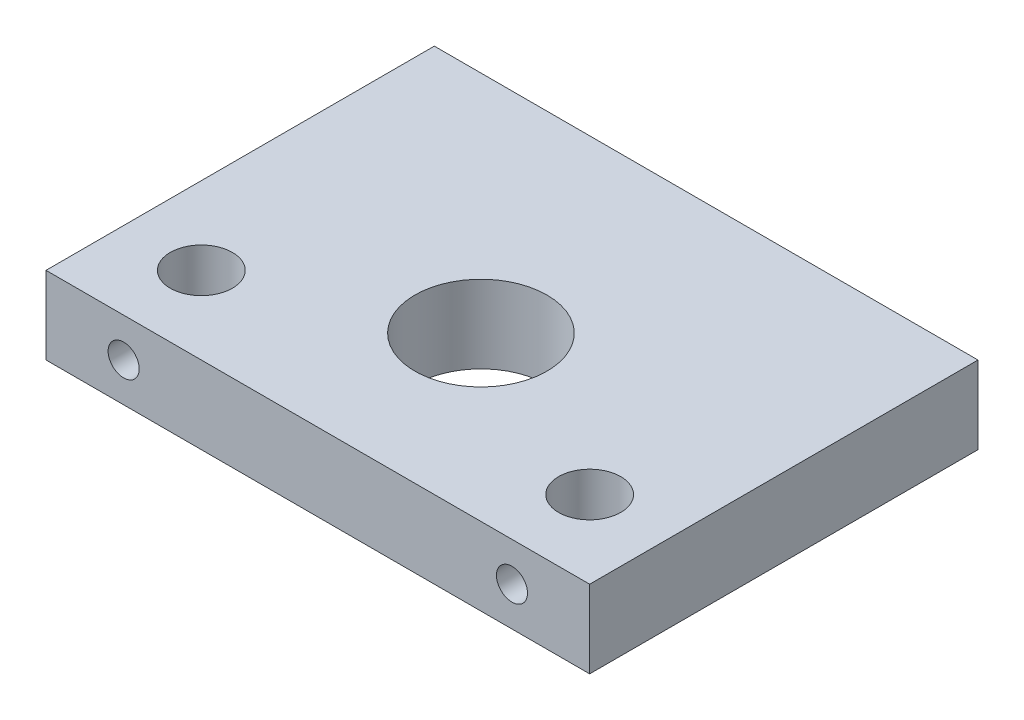
ISO-10303-21;
HEADER;
FILE_DESCRIPTION(('STEP AP214'),'2;1');
FILE_NAME('part.step','',(''),(''),'','','');
FILE_SCHEMA(('AUTOMOTIVE_DESIGN { 1 0 10303 214 1 1 1 1 }'));
ENDSEC;
DATA;
#1=APPLICATION_CONTEXT('core data for automotive mechanical design processes');
#2=APPLICATION_PROTOCOL_DEFINITION('international standard','automotive_design',2000,#1);
#3=PRODUCT_CONTEXT('',#1,'mechanical');
#4=PRODUCT('Part','Part','',(#3));
#5=PRODUCT_RELATED_PRODUCT_CATEGORY('part','',(#4));
#6=PRODUCT_DEFINITION_FORMATION('','',#4);
#7=PRODUCT_DEFINITION_CONTEXT('part definition',#1,'design');
#8=PRODUCT_DEFINITION('design','',#6,#7);
#9=PRODUCT_DEFINITION_SHAPE('','',#8);
#10=(LENGTH_UNIT() NAMED_UNIT(*) SI_UNIT(.MILLI.,.METRE.));
#11=(NAMED_UNIT(*) PLANE_ANGLE_UNIT() SI_UNIT($,.RADIAN.));
#12=(NAMED_UNIT(*) SI_UNIT($,.STERADIAN.) SOLID_ANGLE_UNIT());
#13=UNCERTAINTY_MEASURE_WITH_UNIT(LENGTH_MEASURE(1.E-05),#10,'distance_accuracy_value','');
#14=(GEOMETRIC_REPRESENTATION_CONTEXT(3) GLOBAL_UNCERTAINTY_ASSIGNED_CONTEXT((#13)) GLOBAL_UNIT_ASSIGNED_CONTEXT((#10,
#11,#12)) REPRESENTATION_CONTEXT('',''));
#15=CARTESIAN_POINT('',(0.,0.,0.));
#16=DIRECTION('',(0.,0.,1.));
#17=DIRECTION('',(1.,0.,0.));
#18=AXIS2_PLACEMENT_3D('',#15,#16,#17);
#19=CARTESIAN_POINT('',(-35.,10.,25.));
#20=DIRECTION('',(1.,0.,0.));
#21=DIRECTION('',(0.,0.,-1.));
#22=AXIS2_PLACEMENT_3D('',#19,#20,#21);
#23=PLANE('',#22);
#24=DIRECTION('',(0.,0.,1.));
#25=VECTOR('',#24,1.);
#26=CARTESIAN_POINT('',(-35.,0.,25.));
#27=LINE('',#26,#25);
#28=CARTESIAN_POINT('',(-35.,0.,-25.));
#29=VERTEX_POINT('',#28);
#30=CARTESIAN_POINT('',(-35.,0.,25.));
#31=VERTEX_POINT('',#30);
#32=EDGE_CURVE('E104',#29,#31,#27,.T.);
#33=ORIENTED_EDGE('',*,*,#32,.T.);
#34=DIRECTION('',(0.,-1.,0.));
#35=VECTOR('',#34,1.);
#36=CARTESIAN_POINT('',(-35.,10.,25.));
#37=LINE('',#36,#35);
#38=CARTESIAN_POINT('',(-35.,10.,25.));
#39=VERTEX_POINT('',#38);
#40=EDGE_CURVE('E11',#39,#31,#37,.T.);
#41=ORIENTED_EDGE('',*,*,#40,.F.);
#42=DIRECTION('',(0.,0.,1.));
#43=VECTOR('',#42,1.);
#44=CARTESIAN_POINT('',(-35.,10.,25.));
#45=LINE('',#44,#43);
#46=CARTESIAN_POINT('',(-35.,10.,-25.));
#47=VERTEX_POINT('',#46);
#48=EDGE_CURVE('E91',#47,#39,#45,.T.);
#49=ORIENTED_EDGE('',*,*,#48,.F.);
#50=DIRECTION('',(0.,-1.,0.));
#51=VECTOR('',#50,1.);
#52=CARTESIAN_POINT('',(-35.,10.,-25.));
#53=LINE('',#52,#51);
#54=EDGE_CURVE('E100',#47,#29,#53,.T.);
#55=ORIENTED_EDGE('',*,*,#54,.T.);
#56=EDGE_LOOP('',(#33,#41,#49,#55));
#57=FACE_BOUND('',#56,.T.);
#58=ADVANCED_FACE('F33',(#57),#23,.F.);
#59=CARTESIAN_POINT('',(35.,10.,25.));
#60=DIRECTION('',(0.,0.,-1.));
#61=DIRECTION('',(-1.,0.,0.));
#62=AXIS2_PLACEMENT_3D('',#59,#60,#61);
#63=PLANE('',#62);
#64=CARTESIAN_POINT('',(25.,5.,25.));
#65=DIRECTION('',(0.,0.,1.));
#66=DIRECTION('',(1.,0.,0.));
#67=AXIS2_PLACEMENT_3D('',#64,#65,#66);
#68=CIRCLE('',#67,2.);
#69=CARTESIAN_POINT('',(27.,5.,25.));
#70=VERTEX_POINT('',#69);
#71=EDGE_CURVE('E119',#70,#70,#68,.T.);
#72=ORIENTED_EDGE('',*,*,#71,.F.);
#73=EDGE_LOOP('',(#72));
#74=FACE_BOUND('',#73,.T.);
#75=CARTESIAN_POINT('',(-25.,5.00000000000002,25.));
#76=DIRECTION('',(0.,0.,1.));
#77=DIRECTION('',(-1.,0.,0.));
#78=AXIS2_PLACEMENT_3D('',#75,#76,#77);
#79=CIRCLE('',#78,2.);
#80=CARTESIAN_POINT('',(-27.,5.00000000000002,25.));
#81=VERTEX_POINT('',#80);
#82=EDGE_CURVE('E253',#81,#81,#79,.T.);
#83=ORIENTED_EDGE('',*,*,#82,.F.);
#84=EDGE_LOOP('',(#83));
#85=FACE_BOUND('',#84,.T.);
#86=DIRECTION('',(1.,0.,0.));
#87=VECTOR('',#86,1.);
#88=CARTESIAN_POINT('',(35.,0.,25.));
#89=LINE('',#88,#87);
#90=CARTESIAN_POINT('',(35.,0.,25.));
#91=VERTEX_POINT('',#90);
#92=EDGE_CURVE('E95',#31,#91,#89,.T.);
#93=ORIENTED_EDGE('',*,*,#92,.T.);
#94=DIRECTION('',(0.,-1.,0.));
#95=VECTOR('',#94,1.);
#96=CARTESIAN_POINT('',(35.,10.,25.));
#97=LINE('',#96,#95);
#98=CARTESIAN_POINT('',(35.,10.,25.));
#99=VERTEX_POINT('',#98);
#100=EDGE_CURVE('E47',#99,#91,#97,.T.);
#101=ORIENTED_EDGE('',*,*,#100,.F.);
#102=DIRECTION('',(1.,0.,0.));
#103=VECTOR('',#102,1.);
#104=CARTESIAN_POINT('',(35.,10.,25.));
#105=LINE('',#104,#103);
#106=EDGE_CURVE('E86',#39,#99,#105,.T.);
#107=ORIENTED_EDGE('',*,*,#106,.F.);
#108=ORIENTED_EDGE('',*,*,#40,.T.);
#109=EDGE_LOOP('',(#93,#101,#107,#108));
#110=FACE_BOUND('',#109,.T.);
#111=ADVANCED_FACE('F94',(#74,#85,#110),#63,.F.);
#112=CARTESIAN_POINT('',(35.,10.,25.));
#113=DIRECTION('',(-1.,0.,0.));
#114=DIRECTION('',(0.,0.,1.));
#115=AXIS2_PLACEMENT_3D('',#112,#113,#114);
#116=PLANE('',#115);
#117=DIRECTION('',(0.,0.,-1.));
#118=VECTOR('',#117,1.);
#119=CARTESIAN_POINT('',(35.,0.,25.));
#120=LINE('',#119,#118);
#121=CARTESIAN_POINT('',(35.,0.,-25.));
#122=VERTEX_POINT('',#121);
#123=EDGE_CURVE('E73',#91,#122,#120,.T.);
#124=ORIENTED_EDGE('',*,*,#123,.T.);
#125=DIRECTION('',(0.,-1.,0.));
#126=VECTOR('',#125,1.);
#127=CARTESIAN_POINT('',(35.,10.,-25.));
#128=LINE('',#127,#126);
#129=CARTESIAN_POINT('',(35.,10.,-25.));
#130=VERTEX_POINT('',#129);
#131=EDGE_CURVE('E96',#130,#122,#128,.T.);
#132=ORIENTED_EDGE('',*,*,#131,.F.);
#133=DIRECTION('',(0.,0.,-1.));
#134=VECTOR('',#133,1.);
#135=CARTESIAN_POINT('',(35.,10.,25.));
#136=LINE('',#135,#134);
#137=EDGE_CURVE('E89',#99,#130,#136,.T.);
#138=ORIENTED_EDGE('',*,*,#137,.F.);
#139=ORIENTED_EDGE('',*,*,#100,.T.);
#140=EDGE_LOOP('',(#124,#132,#138,#139));
#141=FACE_BOUND('',#140,.T.);
#142=ADVANCED_FACE('F98',(#141),#116,.F.);
#143=CARTESIAN_POINT('',(35.,10.,-25.));
#144=DIRECTION('',(0.,0.,1.));
#145=DIRECTION('',(1.,0.,0.));
#146=AXIS2_PLACEMENT_3D('',#143,#144,#145);
#147=PLANE('',#146);
#148=DIRECTION('',(-1.,0.,0.));
#149=VECTOR('',#148,1.);
#150=CARTESIAN_POINT('',(35.,0.,-25.));
#151=LINE('',#150,#149);
#152=EDGE_CURVE('E79',#122,#29,#151,.T.);
#153=ORIENTED_EDGE('',*,*,#152,.T.);
#154=ORIENTED_EDGE('',*,*,#54,.F.);
#155=DIRECTION('',(-1.,0.,0.));
#156=VECTOR('',#155,1.);
#157=CARTESIAN_POINT('',(35.,10.,-25.));
#158=LINE('',#157,#156);
#159=EDGE_CURVE('E56',#130,#47,#158,.T.);
#160=ORIENTED_EDGE('',*,*,#159,.F.);
#161=ORIENTED_EDGE('',*,*,#131,.T.);
#162=EDGE_LOOP('',(#153,#154,#160,#161));
#163=FACE_BOUND('',#162,.T.);
#164=ADVANCED_FACE('F156',(#163),#147,.F.);
#165=CARTESIAN_POINT('',(0.,10.,0.));
#166=DIRECTION('',(0.,1.,0.));
#167=DIRECTION('',(0.,0.,1.));
#168=AXIS2_PLACEMENT_3D('',#165,#166,#167);
#169=PLANE('',#168);
#170=CARTESIAN_POINT('',(5.15281762734335E-13,10.,4.));
#171=DIRECTION('',(0.,-1.,0.));
#172=DIRECTION('',(0.,0.,-1.));
#173=AXIS2_PLACEMENT_3D('',#170,#171,#172);
#174=CIRCLE('',#173,8.50000000000002);
#175=CARTESIAN_POINT('',(5.15281762734335E-13,10.,-4.50000000000001));
#176=VERTEX_POINT('',#175);
#177=EDGE_CURVE('E256',#176,#176,#174,.T.);
#178=ORIENTED_EDGE('',*,*,#177,.T.);
#179=EDGE_LOOP('',(#178));
#180=FACE_BOUND('',#179,.T.);
#181=CARTESIAN_POINT('',(-25.,10.,15.));
#182=DIRECTION('',(0.,-1.,0.));
#183=DIRECTION('',(0.,0.,-1.));
#184=AXIS2_PLACEMENT_3D('',#181,#182,#183);
#185=CIRCLE('',#184,4.);
#186=CARTESIAN_POINT('',(-25.,10.,11.));
#187=VERTEX_POINT('',#186);
#188=EDGE_CURVE('E107',#187,#187,#185,.T.);
#189=ORIENTED_EDGE('',*,*,#188,.T.);
#190=EDGE_LOOP('',(#189));
#191=FACE_BOUND('',#190,.T.);
#192=CARTESIAN_POINT('',(25.,10.,15.));
#193=DIRECTION('',(0.,-1.,0.));
#194=DIRECTION('',(0.,0.,1.));
#195=AXIS2_PLACEMENT_3D('',#192,#193,#194);
#196=CIRCLE('',#195,4.);
#197=CARTESIAN_POINT('',(25.,10.,19.));
#198=VERTEX_POINT('',#197);
#199=EDGE_CURVE('E235',#198,#198,#196,.T.);
#200=ORIENTED_EDGE('',*,*,#199,.T.);
#201=EDGE_LOOP('',(#200));
#202=FACE_BOUND('',#201,.T.);
#203=ORIENTED_EDGE('',*,*,#48,.T.);
#204=ORIENTED_EDGE('',*,*,#106,.T.);
#205=ORIENTED_EDGE('',*,*,#137,.T.);
#206=ORIENTED_EDGE('',*,*,#159,.T.);
#207=EDGE_LOOP('',(#203,#204,#205,#206));
#208=FACE_BOUND('',#207,.T.);
#209=ADVANCED_FACE('F87',(#180,#191,#202,#208),#169,.T.);
#210=CARTESIAN_POINT('',(0.,0.,0.));
#211=DIRECTION('',(0.,1.,0.));
#212=DIRECTION('',(0.,0.,1.));
#213=AXIS2_PLACEMENT_3D('',#210,#211,#212);
#214=PLANE('',#213);
#215=CARTESIAN_POINT('',(5.15281762734335E-13,0.,4.));
#216=DIRECTION('',(0.,-1.,0.));
#217=DIRECTION('',(0.,0.,-1.));
#218=AXIS2_PLACEMENT_3D('',#215,#216,#217);
#219=CIRCLE('',#218,8.50000000000002);
#220=CARTESIAN_POINT('',(5.15281762734335E-13,0.,-4.50000000000001));
#221=VERTEX_POINT('',#220);
#222=EDGE_CURVE('E259',#221,#221,#219,.T.);
#223=ORIENTED_EDGE('',*,*,#222,.F.);
#224=EDGE_LOOP('',(#223));
#225=FACE_BOUND('',#224,.T.);
#226=CARTESIAN_POINT('',(-25.,0.,15.));
#227=DIRECTION('',(0.,-1.,0.));
#228=DIRECTION('',(0.,0.,-1.));
#229=AXIS2_PLACEMENT_3D('',#226,#227,#228);
#230=CIRCLE('',#229,4.);
#231=CARTESIAN_POINT('',(-25.,0.,11.));
#232=VERTEX_POINT('',#231);
#233=EDGE_CURVE('E234',#232,#232,#230,.T.);
#234=ORIENTED_EDGE('',*,*,#233,.F.);
#235=EDGE_LOOP('',(#234));
#236=FACE_BOUND('',#235,.T.);
#237=CARTESIAN_POINT('',(25.,0.,15.));
#238=DIRECTION('',(0.,-1.,0.));
#239=DIRECTION('',(0.,0.,1.));
#240=AXIS2_PLACEMENT_3D('',#237,#238,#239);
#241=CIRCLE('',#240,4.);
#242=CARTESIAN_POINT('',(25.,0.,19.));
#243=VERTEX_POINT('',#242);
#244=EDGE_CURVE('E239',#243,#243,#241,.T.);
#245=ORIENTED_EDGE('',*,*,#244,.F.);
#246=EDGE_LOOP('',(#245));
#247=FACE_BOUND('',#246,.T.);
#248=ORIENTED_EDGE('',*,*,#32,.F.);
#249=ORIENTED_EDGE('',*,*,#152,.F.);
#250=ORIENTED_EDGE('',*,*,#123,.F.);
#251=ORIENTED_EDGE('',*,*,#92,.F.);
#252=EDGE_LOOP('',(#248,#249,#250,#251));
#253=FACE_BOUND('',#252,.T.);
#254=ADVANCED_FACE('F146',(#225,#236,#247,#253),#214,.F.);
#255=CARTESIAN_POINT('',(25.,10.,15.));
#256=DIRECTION('',(0.,-1.,0.));
#257=DIRECTION('',(0.,0.,-1.));
#258=AXIS2_PLACEMENT_3D('',#255,#256,#257);
#259=CYLINDRICAL_SURFACE('',#258,4.);
#260=CARTESIAN_POINT('',(27.,5.,18.4641016151378));
#261=CARTESIAN_POINT('',(26.9999915874878,5.10421320547434,18.4641118571589));
#262=CARTESIAN_POINT('',(26.9917996361044,5.2085621765338,18.4688763354498));
#263=CARTESIAN_POINT('',(26.9594467258005,5.4140551772306,18.4872470166907));
#264=CARTESIAN_POINT('',(26.9352522109566,5.51519200324776,18.5008717978818));
#265=CARTESIAN_POINT('',(26.8721998159803,5.71090315644693,18.5349870149));
#266=CARTESIAN_POINT('',(26.8334198829596,5.80550925884925,18.5554408906917));
#267=CARTESIAN_POINT('',(26.7425350724514,5.98684845047615,18.6008532729113));
#268=CARTESIAN_POINT('',(26.6904294741014,6.07358111343677,18.6258120230125));
#269=CARTESIAN_POINT('',(26.569333074538,6.24461144313338,18.6799373881929));
#270=CARTESIAN_POINT('',(26.4993040705353,6.32811826759177,18.709281274651));
#271=CARTESIAN_POINT('',(26.346507616982,6.4828167805706,18.7674396538212));
#272=CARTESIAN_POINT('',(26.2637338520484,6.55400232620397,18.7962538761026));
#273=CARTESIAN_POINT('',(26.0809791263127,6.68673430118849,18.8524295396166));
#274=CARTESIAN_POINT('',(25.9802143778872,6.74730753542331,18.8795621285125));
#275=CARTESIAN_POINT('',(25.7683140533369,6.85028170678709,18.9270151218417));
#276=CARTESIAN_POINT('',(25.657185076312,6.8926941123508,18.9473398236363));
#277=CARTESIAN_POINT('',(25.4360898878188,6.95500932253117,18.9776092249205));
#278=CARTESIAN_POINT('',(25.3266035809688,6.9762990526921,18.9881896044274));
#279=CARTESIAN_POINT('',(25.1051412574046,7.00033223736903,19.0001516769118));
#280=CARTESIAN_POINT('',(24.9931667883148,7.00308691359628,19.0015389356894));
#281=CARTESIAN_POINT('',(24.7803349511504,6.99050665205486,18.9952596383313));
#282=CARTESIAN_POINT('',(24.6793576016459,6.97672396895636,18.9883699178438));
#283=CARTESIAN_POINT('',(24.4813724561639,6.93423831219188,18.9674849051944));
#284=CARTESIAN_POINT('',(24.3843649578123,6.90553422204787,18.9534890813277));
#285=CARTESIAN_POINT('',(24.1953812168607,6.83383486782005,18.9194316657533));
#286=CARTESIAN_POINT('',(24.1034931529696,6.79064737365578,18.899288830584));
#287=CARTESIAN_POINT('',(23.9280463969734,6.6914731675971,18.8547529197337));
#288=CARTESIAN_POINT('',(23.8444907023227,6.63548187339532,18.8303583231497));
#289=CARTESIAN_POINT('',(23.6796526782036,6.50620929693394,18.7768878879846));
#290=CARTESIAN_POINT('',(23.5993318499413,6.43179394334797,18.7475875199635));
#291=CARTESIAN_POINT('',(23.4517912594044,6.27082055013966,18.6890868117362));
#292=CARTESIAN_POINT('',(23.3845815768515,6.18425325545188,18.6598865653126));
#293=CARTESIAN_POINT('',(23.2609893307156,5.99470361515183,18.6028831218497));
#294=CARTESIAN_POINT('',(23.2055653700439,5.89102795389158,18.5752863998142));
#295=CARTESIAN_POINT('',(23.1133617739975,5.67412465728201,18.5275090055715));
#296=CARTESIAN_POINT('',(23.0765626835782,5.56090713396488,18.5073206009214));
#297=CARTESIAN_POINT('',(23.0256395779499,5.33757097743442,18.4788927163407));
#298=CARTESIAN_POINT('',(23.0099497557601,5.2279177619129,18.4698331169699));
#299=CARTESIAN_POINT('',(22.9969661067772,5.00719731696691,18.4623583872322));
#300=CARTESIAN_POINT('',(22.9996592853699,4.89613114176041,18.4639357377863));
#301=CARTESIAN_POINT('',(23.0219279133121,4.68869216284257,18.4766867308117));
#302=CARTESIAN_POINT('',(23.0396243665751,4.59204109778422,18.4867917501331));
#303=CARTESIAN_POINT('',(23.0886074307351,4.40326442745801,18.5138804310268));
#304=CARTESIAN_POINT('',(23.1198984427527,4.31114029850652,18.5308663201007));
#305=CARTESIAN_POINT('',(23.1967048227903,4.12917733819489,18.5707244415931));
#306=CARTESIAN_POINT('',(23.2428118726147,4.03964196629395,18.5938328648613));
#307=CARTESIAN_POINT('',(23.3474258719682,3.86906145692096,18.643122389945));
#308=CARTESIAN_POINT('',(23.405939191335,3.78802071296949,18.669305067103));
#309=CARTESIAN_POINT('',(23.5423256656029,3.62604246495734,18.7257599691267));
#310=CARTESIAN_POINT('',(23.6217094553725,3.54640569858222,18.7561316630857));
#311=CARTESIAN_POINT('',(23.793191009201,3.40117552399527,18.814684699558));
#312=CARTESIAN_POINT('',(23.8852930506801,3.33558685947316,18.8428653001546));
#313=CARTESIAN_POINT('',(24.0829292748919,3.21885254816729,18.8948272338187));
#314=CARTESIAN_POINT('',(24.1887538048875,3.16813376383323,18.9184728334389));
#315=CARTESIAN_POINT('',(24.4089552706821,3.08572419203039,18.9576670991878));
#316=CARTESIAN_POINT('',(24.5233245970824,3.0540166963159,18.973222873534));
#317=CARTESIAN_POINT('',(24.7460406354602,3.01326287251486,18.9933501636318));
#318=CARTESIAN_POINT('',(24.8539771127317,3.00240425133572,18.9987985581427));
#319=CARTESIAN_POINT('',(25.07025197147,2.99831346600433,19.0008426075238));
#320=CARTESIAN_POINT('',(25.1785901989816,3.00507513147113,18.9974413614164));
#321=CARTESIAN_POINT('',(25.3850759861369,3.03483282431641,18.9826793766851));
#322=CARTESIAN_POINT('',(25.4834246410574,3.05672973730905,18.9718578930944));
#323=CARTESIAN_POINT('',(25.6748918989316,3.11465395980667,18.9438418735339));
#324=CARTESIAN_POINT('',(25.7680097496698,3.15068329570691,18.9266464236443));
#325=CARTESIAN_POINT('',(25.9508468335967,3.2374542549914,18.8865186139318));
#326=CARTESIAN_POINT('',(26.0402503657229,3.28875921975186,18.863372340054));
#327=CARTESIAN_POINT('',(26.2095492032683,3.40391528811809,18.8137626667603));
#328=CARTESIAN_POINT('',(26.2894401144432,3.46777215410157,18.7872977458343));
#329=CARTESIAN_POINT('',(26.445828338595,3.61359663555941,18.7305721884058));
#330=CARTESIAN_POINT('',(26.521196658792,3.69673418080028,18.7001959172608));
#331=CARTESIAN_POINT('',(26.6573252839401,3.87489222830609,18.6412615862857));
#332=CARTESIAN_POINT('',(26.7180726652124,3.96992313136051,18.6127051513079));
#333=CARTESIAN_POINT('',(26.8248671471681,4.17330889413024,18.5599918625675));
#334=CARTESIAN_POINT('',(26.8703890238191,4.28198991073527,18.5360025626854));
#335=CARTESIAN_POINT('',(26.923959295048,4.45057811963094,18.5069621813237));
#336=CARTESIAN_POINT('',(26.9393566614797,4.50764782059067,18.498443893294));
#337=CARTESIAN_POINT('',(26.9650806980504,4.62323255750019,18.4840605932354));
#338=CARTESIAN_POINT('',(26.9754109134328,4.68174655275425,18.4781937263605));
#339=CARTESIAN_POINT('',(26.9887293296122,4.78360078924729,18.4705902366876));
#340=CARTESIAN_POINT('',(26.9929509198379,4.82673305725007,18.4681638973182));
#341=CARTESIAN_POINT('',(26.9985881003561,4.91323569309289,18.4649174004518));
#342=CARTESIAN_POINT('',(27.0000035029333,4.9566060766667,18.4640973504049));
#343=CARTESIAN_POINT('',(27.,5.,18.4641016151378));
#344=B_SPLINE_CURVE_WITH_KNOTS('',3,(#260,#261,#262,#263,#264,#265,#266,#267,#268,#269,#270,
#271,#272,#273,#274,#275,#276,#277,#278,#279,#280,#281,#282,#283,#284,#285,#286,#287,#288,#289,
#290,#291,#292,#293,#294,#295,#296,#297,#298,#299,#300,#301,#302,#303,#304,#305,#306,#307,#308,
#309,#310,#311,#312,#313,#314,#315,#316,#317,#318,#319,#320,#321,#322,#323,#324,#325,#326,#327,
#328,#329,#330,#331,#332,#333,#334,#335,#336,#337,#338,#339,#340,#341,#342,#343),.UNSPECIFIED.,
.T.,.F.,(4,2,2,2,2,2,2,2,2,2,2,2,2,2,2,2,2,2,2,2,2,2,2,2,2,2,2,2,2,2,2,2,2,2,2,2,2,2,2,2,2,4),
(0.,0.312464245189431,0.625585785649608,0.937057191861534,1.24854545093096,1.58572462503713,
1.92307142172808,2.28315784481593,2.64301653931848,2.97726969939936,3.31132047376146,
3.61632194973143,3.92134625038977,4.2305906946636,4.5399459870461,4.87854382917848,
5.21740096495903,5.57777683462963,5.93777548427476,6.2692458171249,6.60048186380812,
6.89548366852117,7.19058104876192,7.49934592816241,7.80826972444161,8.15613487165292,
8.5041172996047,8.86128362829998,9.2181355962161,9.5422454078304,9.8662417359201,
10.1688884974705,10.4715786702809,10.7872150144301,11.102996602055,11.450204837042,
11.7977188569437,12.1562149808128,12.3351395323571,12.5139387197526,12.6440387634036,
12.7741475095882),.UNSPECIFIED.);
#345=CARTESIAN_POINT('',(27.,5.,18.4641016151378));
#346=VERTEX_POINT('',#345);
#347=EDGE_CURVE('E36',#346,#346,#344,.T.);
#348=ORIENTED_EDGE('',*,*,#347,.T.);
#349=EDGE_LOOP('',(#348));
#350=FACE_BOUND('',#349,.T.);
#351=ORIENTED_EDGE('',*,*,#199,.F.);
#352=EDGE_LOOP('',(#351));
#353=FACE_BOUND('',#352,.T.);
#354=ORIENTED_EDGE('',*,*,#244,.T.);
#355=EDGE_LOOP('',(#354));
#356=FACE_BOUND('',#355,.T.);
#357=ADVANCED_FACE('F148',(#350,#353,#356),#259,.F.);
#358=CARTESIAN_POINT('',(-25.,10.,15.));
#359=DIRECTION('',(0.,-1.,0.));
#360=DIRECTION('',(0.,0.,-1.));
#361=AXIS2_PLACEMENT_3D('',#358,#359,#360);
#362=CYLINDRICAL_SURFACE('',#361,4.);
#363=CARTESIAN_POINT('',(-23.,5.00000000000002,18.4641016151378));
#364=CARTESIAN_POINT('',(-23.0000084125122,5.10421320547437,18.4641118571589));
#365=CARTESIAN_POINT('',(-23.0082003638956,5.20856217653382,18.4688763354498));
#366=CARTESIAN_POINT('',(-23.0405532741995,5.41405517723063,18.4872470166907));
#367=CARTESIAN_POINT('',(-23.0647477890434,5.51519200324779,18.5008717978818));
#368=CARTESIAN_POINT('',(-23.1278001840197,5.71090315644696,18.5349870149));
#369=CARTESIAN_POINT('',(-23.1665801170404,5.80550925884927,18.5554408906917));
#370=CARTESIAN_POINT('',(-23.2574649275486,5.98684845047618,18.6008532729113));
#371=CARTESIAN_POINT('',(-23.3095705258986,6.0735811134368,18.6258120230125));
#372=CARTESIAN_POINT('',(-23.430666925462,6.24461144313341,18.6799373881929));
#373=CARTESIAN_POINT('',(-23.5006959294647,6.3281182675918,18.709281274651));
#374=CARTESIAN_POINT('',(-23.653492383018,6.48281678057063,18.7674396538212));
#375=CARTESIAN_POINT('',(-23.7362661479516,6.554002326204,18.7962538761026));
#376=CARTESIAN_POINT('',(-23.9190208736874,6.68673430118852,18.8524295396166));
#377=CARTESIAN_POINT('',(-24.0197856221128,6.74730753542333,18.8795621285125));
#378=CARTESIAN_POINT('',(-24.2316859466631,6.85028170678711,18.9270151218417));
#379=CARTESIAN_POINT('',(-24.342814923688,6.89269411235082,18.9473398236363));
#380=CARTESIAN_POINT('',(-24.5639101121812,6.9550093225312,18.9776092249205));
#381=CARTESIAN_POINT('',(-24.6733964190312,6.97629905269213,18.9881896044274));
#382=CARTESIAN_POINT('',(-24.8948587425955,7.00033223736906,19.0001516769118));
#383=CARTESIAN_POINT('',(-25.0068332116852,7.00308691359631,19.0015389356894));
#384=CARTESIAN_POINT('',(-25.2196650488496,6.99050665205488,18.9952596383312));
#385=CARTESIAN_POINT('',(-25.3206423983541,6.97672396895639,18.9883699178438));
#386=CARTESIAN_POINT('',(-25.5186275438361,6.9342383121919,18.9674849051944));
#387=CARTESIAN_POINT('',(-25.6156350421877,6.9055342220479,18.9534890813277));
#388=CARTESIAN_POINT('',(-25.8046187831393,6.83383486782007,18.9194316657533));
#389=CARTESIAN_POINT('',(-25.8965068470304,6.7906473736558,18.899288830584));
#390=CARTESIAN_POINT('',(-26.0719536030266,6.69147316759713,18.8547529197337));
#391=CARTESIAN_POINT('',(-26.1555092976773,6.63548187339535,18.8303583231497));
#392=CARTESIAN_POINT('',(-26.3203473217964,6.50620929693397,18.7768878879846));
#393=CARTESIAN_POINT('',(-26.4006681500587,6.431793943348,18.7475875199635));
#394=CARTESIAN_POINT('',(-26.5482087405956,6.27082055013968,18.6890868117362));
#395=CARTESIAN_POINT('',(-26.6154184231485,6.1842532554519,18.6598865653126));
#396=CARTESIAN_POINT('',(-26.7390106692844,5.99470361515185,18.6028831218497));
#397=CARTESIAN_POINT('',(-26.7944346299561,5.8910279538916,18.5752863998142));
#398=CARTESIAN_POINT('',(-26.8866382260025,5.67412465728203,18.5275090055715));
#399=CARTESIAN_POINT('',(-26.9234373164218,5.5609071339649,18.5073206009214));
#400=CARTESIAN_POINT('',(-26.9743604220501,5.33757097743444,18.4788927163407));
#401=CARTESIAN_POINT('',(-26.99005024424,5.22791776191293,18.4698331169699));
#402=CARTESIAN_POINT('',(-27.0030338932229,5.00719731696693,18.4623583872322));
#403=CARTESIAN_POINT('',(-27.0003407146301,4.89613114176043,18.4639357377862));
#404=CARTESIAN_POINT('',(-26.9780720866879,4.68869216284259,18.4766867308117));
#405=CARTESIAN_POINT('',(-26.9603756334249,4.59204109778424,18.4867917501331));
#406=CARTESIAN_POINT('',(-26.9113925692649,4.40326442745804,18.5138804310268));
#407=CARTESIAN_POINT('',(-26.8801015572473,4.31114029850654,18.5308663201007));
#408=CARTESIAN_POINT('',(-26.8032951772097,4.12917733819491,18.5707244415931));
#409=CARTESIAN_POINT('',(-26.7571881273853,4.03964196629398,18.5938328648613));
#410=CARTESIAN_POINT('',(-26.6525741280318,3.86906145692099,18.643122389945));
#411=CARTESIAN_POINT('',(-26.594060808665,3.78802071296952,18.669305067103));
#412=CARTESIAN_POINT('',(-26.4576743343971,3.62604246495737,18.7257599691267));
#413=CARTESIAN_POINT('',(-26.3782905446275,3.54640569858225,18.7561316630857));
#414=CARTESIAN_POINT('',(-26.206808990799,3.4011755239953,18.814684699558));
#415=CARTESIAN_POINT('',(-26.1147069493199,3.33558685947319,18.8428653001546));
#416=CARTESIAN_POINT('',(-25.9170707251081,3.21885254816732,18.8948272338187));
#417=CARTESIAN_POINT('',(-25.8112461951125,3.16813376383326,18.9184728334388));
#418=CARTESIAN_POINT('',(-25.5910447293179,3.08572419203041,18.9576670991878));
#419=CARTESIAN_POINT('',(-25.4766754029177,3.05401669631593,18.973222873534));
#420=CARTESIAN_POINT('',(-25.2539593645398,3.01326287251489,18.9933501636317));
#421=CARTESIAN_POINT('',(-25.1460228872683,3.00240425133575,18.9987985581427));
#422=CARTESIAN_POINT('',(-24.9297480285301,2.99831346600435,19.0008426075237));
#423=CARTESIAN_POINT('',(-24.8214098010184,3.00507513147116,18.9974413614163));
#424=CARTESIAN_POINT('',(-24.6149240138631,3.03483282431643,18.9826793766851));
#425=CARTESIAN_POINT('',(-24.5165753589426,3.05672973730908,18.9718578930944));
#426=CARTESIAN_POINT('',(-24.3251081010684,3.11465395980669,18.9438418735339));
#427=CARTESIAN_POINT('',(-24.2319902503302,3.15068329570694,18.9266464236442));
#428=CARTESIAN_POINT('',(-24.0491531664033,3.23745425499143,18.8865186139318));
#429=CARTESIAN_POINT('',(-23.9597496342771,3.28875921975188,18.863372340054));
#430=CARTESIAN_POINT('',(-23.7904507967317,3.40391528811812,18.8137626667603));
#431=CARTESIAN_POINT('',(-23.7105598855568,3.46777215410159,18.7872977458343));
#432=CARTESIAN_POINT('',(-23.5541716614051,3.61359663555944,18.7305721884058));
#433=CARTESIAN_POINT('',(-23.478803341208,3.69673418080031,18.7001959172608));
#434=CARTESIAN_POINT('',(-23.3426747160599,3.87489222830611,18.6412615862857));
#435=CARTESIAN_POINT('',(-23.2819273347876,3.96992313136054,18.6127051513079));
#436=CARTESIAN_POINT('',(-23.1751328528319,4.17330889413027,18.5599918625675));
#437=CARTESIAN_POINT('',(-23.1296109761809,4.2819899107353,18.5360025626854));
#438=CARTESIAN_POINT('',(-23.076040704952,4.45057811963097,18.5069621813237));
#439=CARTESIAN_POINT('',(-23.0606433385203,4.5076478205907,18.498443893294));
#440=CARTESIAN_POINT('',(-23.0349193019496,4.62323255750021,18.4840605932354));
#441=CARTESIAN_POINT('',(-23.0245890865672,4.68174655275427,18.4781937263605));
#442=CARTESIAN_POINT('',(-23.0112706703878,4.78360078924731,18.4705902366876));
#443=CARTESIAN_POINT('',(-23.0070490801621,4.8267330572501,18.4681638973182));
#444=CARTESIAN_POINT('',(-23.0014118996439,4.91323569309292,18.4649174004518));
#445=CARTESIAN_POINT('',(-22.9999964970667,4.95660607666672,18.4640973504049));
#446=CARTESIAN_POINT('',(-23.,5.00000000000002,18.4641016151378));
#447=B_SPLINE_CURVE_WITH_KNOTS('',3,(#363,#364,#365,#366,#367,#368,#369,#370,#371,#372,#373,
#374,#375,#376,#377,#378,#379,#380,#381,#382,#383,#384,#385,#386,#387,#388,#389,#390,#391,#392,
#393,#394,#395,#396,#397,#398,#399,#400,#401,#402,#403,#404,#405,#406,#407,#408,#409,#410,#411,
#412,#413,#414,#415,#416,#417,#418,#419,#420,#421,#422,#423,#424,#425,#426,#427,#428,#429,#430,
#431,#432,#433,#434,#435,#436,#437,#438,#439,#440,#441,#442,#443,#444,#445,#446),.UNSPECIFIED.,
.T.,.F.,(4,2,2,2,2,2,2,2,2,2,2,2,2,2,2,2,2,2,2,2,2,2,2,2,2,2,2,2,2,2,2,2,2,2,2,2,2,2,2,2,2,4),
(0.,0.312464245189433,0.625585785649609,0.937057191861534,1.24854545093096,1.58572462503713,
1.92307142172809,2.28315784481593,2.64301653931849,2.97726969939937,3.31132047376146,
3.61632194973143,3.92134625038977,4.2305906946636,4.5399459870461,4.87854382917848,
5.21740096495904,5.57777683462963,5.93777548427476,6.2692458171249,6.60048186380813,
6.89548366852118,7.19058104876193,7.49934592816242,7.80826972444161,8.15613487165292,
8.50411729960471,8.86128362829998,9.2181355962161,9.5422454078304,9.8662417359201,
10.1688884974705,10.4715786702809,10.7872150144301,11.102996602055,11.450204837042,
11.7977188569437,12.1562149808128,12.3351395323571,12.5139387197526,12.6440387634036,
12.7741475095882),.UNSPECIFIED.);
#448=CARTESIAN_POINT('',(-23.,5.00000000000002,18.4641016151378));
#449=VERTEX_POINT('',#448);
#450=EDGE_CURVE('E112',#449,#449,#447,.T.);
#451=ORIENTED_EDGE('',*,*,#450,.T.);
#452=EDGE_LOOP('',(#451));
#453=FACE_BOUND('',#452,.T.);
#454=ORIENTED_EDGE('',*,*,#188,.F.);
#455=EDGE_LOOP('',(#454));
#456=FACE_BOUND('',#455,.T.);
#457=ORIENTED_EDGE('',*,*,#233,.T.);
#458=EDGE_LOOP('',(#457));
#459=FACE_BOUND('',#458,.T.);
#460=ADVANCED_FACE('F120',(#453,#456,#459),#362,.F.);
#461=CARTESIAN_POINT('',(-25.,5.00000000000002,15.));
#462=DIRECTION('',(0.,0.,1.));
#463=DIRECTION('',(1.,0.,0.));
#464=AXIS2_PLACEMENT_3D('',#461,#462,#463);
#465=CYLINDRICAL_SURFACE('',#464,2.);
#466=ORIENTED_EDGE('',*,*,#82,.T.);
#467=EDGE_LOOP('',(#466));
#468=FACE_BOUND('',#467,.T.);
#469=ORIENTED_EDGE('',*,*,#450,.F.);
#470=EDGE_LOOP('',(#469));
#471=FACE_BOUND('',#470,.T.);
#472=ADVANCED_FACE('F122',(#468,#471),#465,.F.);
#473=CARTESIAN_POINT('',(25.,5.,15.));
#474=DIRECTION('',(0.,0.,1.));
#475=DIRECTION('',(1.,0.,0.));
#476=AXIS2_PLACEMENT_3D('',#473,#474,#475);
#477=CYLINDRICAL_SURFACE('',#476,2.);
#478=ORIENTED_EDGE('',*,*,#71,.T.);
#479=EDGE_LOOP('',(#478));
#480=FACE_BOUND('',#479,.T.);
#481=ORIENTED_EDGE('',*,*,#347,.F.);
#482=EDGE_LOOP('',(#481));
#483=FACE_BOUND('',#482,.T.);
#484=ADVANCED_FACE('F125',(#480,#483),#477,.F.);
#485=CARTESIAN_POINT('',(5.15281762734335E-13,10.,4.));
#486=DIRECTION('',(0.,-1.,0.));
#487=DIRECTION('',(0.,0.,-1.));
#488=AXIS2_PLACEMENT_3D('',#485,#486,#487);
#489=CYLINDRICAL_SURFACE('',#488,8.50000000000002);
#490=ORIENTED_EDGE('',*,*,#177,.F.);
#491=EDGE_LOOP('',(#490));
#492=FACE_BOUND('',#491,.T.);
#493=ORIENTED_EDGE('',*,*,#222,.T.);
#494=EDGE_LOOP('',(#493));
#495=FACE_BOUND('',#494,.T.);
#496=ADVANCED_FACE('F130',(#492,#495),#489,.F.);
#497=CLOSED_SHELL('',(#58,#111,#142,#164,#209,#254,#357,#460,#472,#484,#496));
#498=MANIFOLD_SOLID_BREP('B2',#497);
#499=ADVANCED_BREP_SHAPE_REPRESENTATION('',(#18,#498),#14);
#500=SHAPE_DEFINITION_REPRESENTATION(#9,#499);
ENDSEC;
END-ISO-10303-21;
